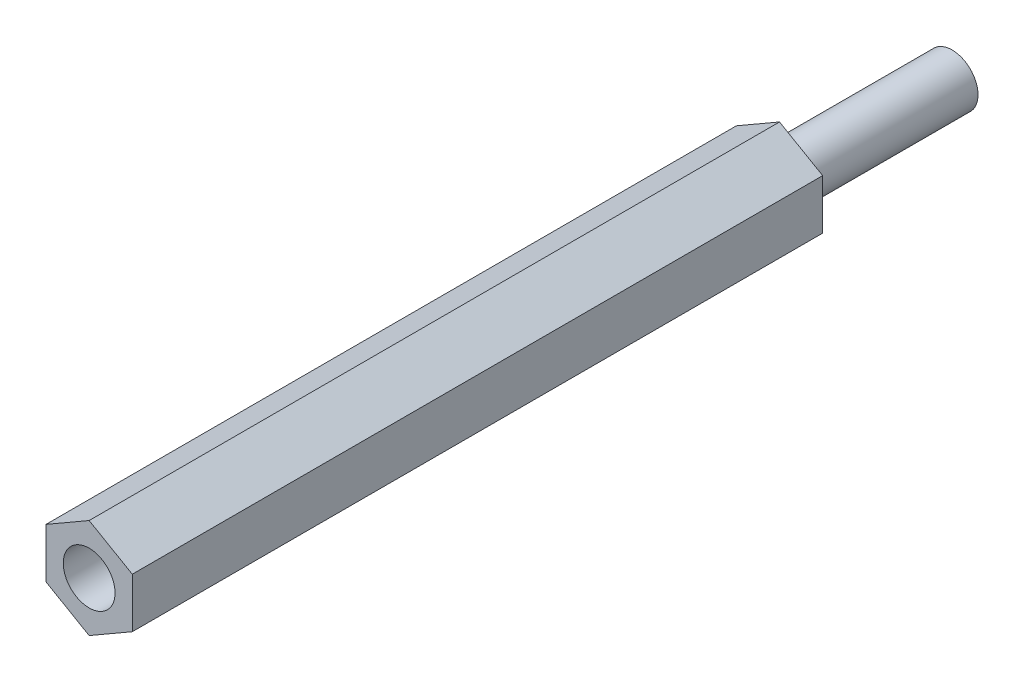
ISO-10303-21;
HEADER;
FILE_DESCRIPTION(('STEP AP214'),'2;1');
FILE_NAME('part.step','',(''),(''),'','','');
FILE_SCHEMA(('AUTOMOTIVE_DESIGN { 1 0 10303 214 1 1 1 1 }'));
ENDSEC;
DATA;
#1=APPLICATION_CONTEXT('core data for automotive mechanical design processes');
#2=APPLICATION_PROTOCOL_DEFINITION('international standard','automotive_design',2000,#1);
#3=PRODUCT_CONTEXT('',#1,'mechanical');
#4=PRODUCT('Part','Part','',(#3));
#5=PRODUCT_RELATED_PRODUCT_CATEGORY('part','',(#4));
#6=PRODUCT_DEFINITION_FORMATION('','',#4);
#7=PRODUCT_DEFINITION_CONTEXT('part definition',#1,'design');
#8=PRODUCT_DEFINITION('design','',#6,#7);
#9=PRODUCT_DEFINITION_SHAPE('','',#8);
#10=(LENGTH_UNIT() NAMED_UNIT(*) SI_UNIT(.MILLI.,.METRE.));
#11=(NAMED_UNIT(*) PLANE_ANGLE_UNIT() SI_UNIT($,.RADIAN.));
#12=(NAMED_UNIT(*) SI_UNIT($,.STERADIAN.) SOLID_ANGLE_UNIT());
#13=UNCERTAINTY_MEASURE_WITH_UNIT(LENGTH_MEASURE(1.E-05),#10,'distance_accuracy_value','');
#14=(GEOMETRIC_REPRESENTATION_CONTEXT(3) GLOBAL_UNCERTAINTY_ASSIGNED_CONTEXT((#13)) GLOBAL_UNIT_ASSIGNED_CONTEXT((#10,
#11,#12)) REPRESENTATION_CONTEXT('',''));
#15=CARTESIAN_POINT('',(0.,0.,0.));
#16=DIRECTION('',(0.,0.,1.));
#17=DIRECTION('',(1.,0.,0.));
#18=AXIS2_PLACEMENT_3D('',#15,#16,#17);
#19=CARTESIAN_POINT('',(0.,0.,40.));
#20=DIRECTION('',(0.,0.,-1.));
#21=DIRECTION('',(-1.,0.,0.));
#22=AXIS2_PLACEMENT_3D('',#19,#20,#21);
#23=CYLINDRICAL_SURFACE('',#22,1.5);
#24=CARTESIAN_POINT('',(0.,0.,40.));
#25=DIRECTION('',(0.,0.,1.));
#26=DIRECTION('',(1.,0.,0.));
#27=AXIS2_PLACEMENT_3D('',#24,#25,#26);
#28=CIRCLE('',#27,1.5);
#29=CARTESIAN_POINT('',(1.5,0.,40.));
#30=VERTEX_POINT('',#29);
#31=EDGE_CURVE('E143',#30,#30,#28,.T.);
#32=ORIENTED_EDGE('',*,*,#31,.T.);
#33=EDGE_LOOP('',(#32));
#34=FACE_BOUND('',#33,.T.);
#35=CARTESIAN_POINT('',(0.,0.,30.));
#36=DIRECTION('',(0.,0.,-1.));
#37=DIRECTION('',(-1.,0.,0.));
#38=AXIS2_PLACEMENT_3D('',#35,#36,#37);
#39=CIRCLE('',#38,1.5);
#40=CARTESIAN_POINT('',(-1.5,0.,30.));
#41=VERTEX_POINT('',#40);
#42=EDGE_CURVE('E249',#41,#41,#39,.T.);
#43=ORIENTED_EDGE('',*,*,#42,.T.);
#44=EDGE_LOOP('',(#43));
#45=FACE_BOUND('',#44,.T.);
#46=ADVANCED_FACE('F53',(#34,#45),#23,.F.);
#47=CARTESIAN_POINT('',(0.,0.,40.));
#48=DIRECTION('',(0.,0.,1.));
#49=DIRECTION('',(1.,0.,0.));
#50=AXIS2_PLACEMENT_3D('',#47,#48,#49);
#51=PLANE('',#50);
#52=DIRECTION('',(0.866025403784439,-0.5,0.));
#53=VECTOR('',#52,1.);
#54=CARTESIAN_POINT('',(-2.5,-1.44337567297406,40.));
#55=LINE('',#54,#53);
#56=CARTESIAN_POINT('',(-2.5,-1.44337567297406,40.));
#57=VERTEX_POINT('',#56);
#58=CARTESIAN_POINT('',(0.,-2.88675134594813,40.));
#59=VERTEX_POINT('',#58);
#60=EDGE_CURVE('E150',#57,#59,#55,.T.);
#61=ORIENTED_EDGE('',*,*,#60,.T.);
#62=DIRECTION('',(0.866025403784438,0.5,0.));
#63=VECTOR('',#62,1.);
#64=CARTESIAN_POINT('',(0.,-2.88675134594813,40.));
#65=LINE('',#64,#63);
#66=CARTESIAN_POINT('',(2.5,-1.44337567297406,40.));
#67=VERTEX_POINT('',#66);
#68=EDGE_CURVE('E107',#59,#67,#65,.T.);
#69=ORIENTED_EDGE('',*,*,#68,.T.);
#70=DIRECTION('',(0.,1.,0.));
#71=VECTOR('',#70,1.);
#72=CARTESIAN_POINT('',(2.5,-1.44337567297406,40.));
#73=LINE('',#72,#71);
#74=CARTESIAN_POINT('',(2.5,1.44337567297407,40.));
#75=VERTEX_POINT('',#74);
#76=EDGE_CURVE('E121',#67,#75,#73,.T.);
#77=ORIENTED_EDGE('',*,*,#76,.T.);
#78=DIRECTION('',(-0.866025403784439,0.5,0.));
#79=VECTOR('',#78,1.);
#80=CARTESIAN_POINT('',(2.5,1.44337567297407,40.));
#81=LINE('',#80,#79);
#82=CARTESIAN_POINT('',(0.,2.88675134594813,40.));
#83=VERTEX_POINT('',#82);
#84=EDGE_CURVE('E114',#75,#83,#81,.T.);
#85=ORIENTED_EDGE('',*,*,#84,.T.);
#86=DIRECTION('',(-0.866025403784439,-0.5,0.));
#87=VECTOR('',#86,1.);
#88=CARTESIAN_POINT('',(0.,2.88675134594813,40.));
#89=LINE('',#88,#87);
#90=CARTESIAN_POINT('',(-2.5,1.44337567297406,40.));
#91=VERTEX_POINT('',#90);
#92=EDGE_CURVE('E119',#83,#91,#89,.T.);
#93=ORIENTED_EDGE('',*,*,#92,.T.);
#94=DIRECTION('',(0.,-1.,0.));
#95=VECTOR('',#94,1.);
#96=CARTESIAN_POINT('',(-2.5,1.44337567297406,40.));
#97=LINE('',#96,#95);
#98=EDGE_CURVE('E70',#91,#57,#97,.T.);
#99=ORIENTED_EDGE('',*,*,#98,.T.);
#100=EDGE_LOOP('',(#61,#69,#77,#85,#93,#99));
#101=FACE_BOUND('',#100,.T.);
#102=ORIENTED_EDGE('',*,*,#31,.F.);
#103=EDGE_LOOP('',(#102));
#104=FACE_BOUND('',#103,.T.);
#105=ADVANCED_FACE('F116',(#101,#104),#51,.T.);
#106=CARTESIAN_POINT('',(0.,0.,0.));
#107=DIRECTION('',(0.,0.,1.));
#108=DIRECTION('',(1.,0.,0.));
#109=AXIS2_PLACEMENT_3D('',#106,#107,#108);
#110=PLANE('',#109);
#111=DIRECTION('',(0.866025403784439,-0.5,0.));
#112=VECTOR('',#111,1.);
#113=CARTESIAN_POINT('',(-2.5,-1.44337567297406,0.));
#114=LINE('',#113,#112);
#115=CARTESIAN_POINT('',(-2.5,-1.44337567297406,0.));
#116=VERTEX_POINT('',#115);
#117=CARTESIAN_POINT('',(0.,-2.88675134594813,0.));
#118=VERTEX_POINT('',#117);
#119=EDGE_CURVE('E139',#116,#118,#114,.T.);
#120=ORIENTED_EDGE('',*,*,#119,.F.);
#121=DIRECTION('',(0.,-1.,0.));
#122=VECTOR('',#121,1.);
#123=CARTESIAN_POINT('',(-2.5,1.44337567297406,0.));
#124=LINE('',#123,#122);
#125=CARTESIAN_POINT('',(-2.5,1.44337567297406,0.));
#126=VERTEX_POINT('',#125);
#127=EDGE_CURVE('E99',#126,#116,#124,.T.);
#128=ORIENTED_EDGE('',*,*,#127,.F.);
#129=DIRECTION('',(-0.866025403784439,-0.5,0.));
#130=VECTOR('',#129,1.);
#131=CARTESIAN_POINT('',(0.,2.88675134594813,0.));
#132=LINE('',#131,#130);
#133=CARTESIAN_POINT('',(0.,2.88675134594813,0.));
#134=VERTEX_POINT('',#133);
#135=EDGE_CURVE('E93',#134,#126,#132,.T.);
#136=ORIENTED_EDGE('',*,*,#135,.F.);
#137=DIRECTION('',(-0.866025403784439,0.5,0.));
#138=VECTOR('',#137,1.);
#139=CARTESIAN_POINT('',(2.5,1.44337567297407,0.));
#140=LINE('',#139,#138);
#141=CARTESIAN_POINT('',(2.5,1.44337567297407,0.));
#142=VERTEX_POINT('',#141);
#143=EDGE_CURVE('E129',#142,#134,#140,.T.);
#144=ORIENTED_EDGE('',*,*,#143,.F.);
#145=DIRECTION('',(0.,1.,0.));
#146=VECTOR('',#145,1.);
#147=CARTESIAN_POINT('',(2.5,-1.44337567297406,0.));
#148=LINE('',#147,#146);
#149=CARTESIAN_POINT('',(2.5,-1.44337567297406,0.));
#150=VERTEX_POINT('',#149);
#151=EDGE_CURVE('E145',#150,#142,#148,.T.);
#152=ORIENTED_EDGE('',*,*,#151,.F.);
#153=DIRECTION('',(0.866025403784438,0.5,0.));
#154=VECTOR('',#153,1.);
#155=CARTESIAN_POINT('',(0.,-2.88675134594813,0.));
#156=LINE('',#155,#154);
#157=EDGE_CURVE('E142',#118,#150,#156,.T.);
#158=ORIENTED_EDGE('',*,*,#157,.F.);
#159=EDGE_LOOP('',(#120,#128,#136,#144,#152,#158));
#160=FACE_BOUND('',#159,.T.);
#161=CARTESIAN_POINT('',(0.,0.,0.));
#162=DIRECTION('',(0.,0.,1.));
#163=DIRECTION('',(1.,0.,0.));
#164=AXIS2_PLACEMENT_3D('',#161,#162,#163);
#165=CIRCLE('',#164,1.5);
#166=CARTESIAN_POINT('',(1.5,0.,0.));
#167=VERTEX_POINT('',#166);
#168=EDGE_CURVE('E248',#167,#167,#165,.F.);
#169=ORIENTED_EDGE('',*,*,#168,.F.);
#170=EDGE_LOOP('',(#169));
#171=FACE_BOUND('',#170,.T.);
#172=ADVANCED_FACE('F159',(#160,#171),#110,.F.);
#173=CARTESIAN_POINT('',(-2.5,-1.44337567297406,40.));
#174=DIRECTION('',(0.5,0.866025403784439,0.));
#175=DIRECTION('',(-0.866025403784439,0.5,0.));
#176=AXIS2_PLACEMENT_3D('',#173,#174,#175);
#177=PLANE('',#176);
#178=ORIENTED_EDGE('',*,*,#119,.T.);
#179=DIRECTION('',(0.,0.,-1.));
#180=VECTOR('',#179,1.);
#181=CARTESIAN_POINT('',(0.,-2.88675134594813,40.));
#182=LINE('',#181,#180);
#183=EDGE_CURVE('E12',#59,#118,#182,.T.);
#184=ORIENTED_EDGE('',*,*,#183,.F.);
#185=ORIENTED_EDGE('',*,*,#60,.F.);
#186=DIRECTION('',(0.,0.,-1.));
#187=VECTOR('',#186,1.);
#188=CARTESIAN_POINT('',(-2.5,-1.44337567297406,40.));
#189=LINE('',#188,#187);
#190=EDGE_CURVE('E135',#57,#116,#189,.T.);
#191=ORIENTED_EDGE('',*,*,#190,.T.);
#192=EDGE_LOOP('',(#178,#184,#185,#191));
#193=FACE_BOUND('',#192,.T.);
#194=ADVANCED_FACE('F55',(#193),#177,.F.);
#195=CARTESIAN_POINT('',(0.,-2.88675134594813,40.));
#196=DIRECTION('',(-0.5,0.866025403784439,0.));
#197=DIRECTION('',(-0.866025403784439,-0.5,0.));
#198=AXIS2_PLACEMENT_3D('',#195,#196,#197);
#199=PLANE('',#198);
#200=ORIENTED_EDGE('',*,*,#157,.T.);
#201=DIRECTION('',(0.,0.,-1.));
#202=VECTOR('',#201,1.);
#203=CARTESIAN_POINT('',(2.5,-1.44337567297406,40.));
#204=LINE('',#203,#202);
#205=EDGE_CURVE('E62',#67,#150,#204,.T.);
#206=ORIENTED_EDGE('',*,*,#205,.F.);
#207=ORIENTED_EDGE('',*,*,#68,.F.);
#208=ORIENTED_EDGE('',*,*,#183,.T.);
#209=EDGE_LOOP('',(#200,#206,#207,#208));
#210=FACE_BOUND('',#209,.T.);
#211=ADVANCED_FACE('F192',(#210),#199,.F.);
#212=CARTESIAN_POINT('',(2.5,-1.44337567297406,40.));
#213=DIRECTION('',(-1.,0.,0.));
#214=DIRECTION('',(0.,-1.,0.));
#215=AXIS2_PLACEMENT_3D('',#212,#213,#214);
#216=PLANE('',#215);
#217=ORIENTED_EDGE('',*,*,#151,.T.);
#218=DIRECTION('',(0.,0.,-1.));
#219=VECTOR('',#218,1.);
#220=CARTESIAN_POINT('',(2.5,1.44337567297407,40.));
#221=LINE('',#220,#219);
#222=EDGE_CURVE('E130',#75,#142,#221,.T.);
#223=ORIENTED_EDGE('',*,*,#222,.F.);
#224=ORIENTED_EDGE('',*,*,#76,.F.);
#225=ORIENTED_EDGE('',*,*,#205,.T.);
#226=EDGE_LOOP('',(#217,#223,#224,#225));
#227=FACE_BOUND('',#226,.T.);
#228=ADVANCED_FACE('F156',(#227),#216,.F.);
#229=CARTESIAN_POINT('',(2.5,1.44337567297407,40.));
#230=DIRECTION('',(-0.5,-0.866025403784439,0.));
#231=DIRECTION('',(0.866025403784439,-0.5,0.));
#232=AXIS2_PLACEMENT_3D('',#229,#230,#231);
#233=PLANE('',#232);
#234=ORIENTED_EDGE('',*,*,#143,.T.);
#235=DIRECTION('',(0.,0.,-1.));
#236=VECTOR('',#235,1.);
#237=CARTESIAN_POINT('',(0.,2.88675134594813,40.));
#238=LINE('',#237,#236);
#239=EDGE_CURVE('E126',#83,#134,#238,.T.);
#240=ORIENTED_EDGE('',*,*,#239,.F.);
#241=ORIENTED_EDGE('',*,*,#84,.F.);
#242=ORIENTED_EDGE('',*,*,#222,.T.);
#243=EDGE_LOOP('',(#234,#240,#241,#242));
#244=FACE_BOUND('',#243,.T.);
#245=ADVANCED_FACE('F127',(#244),#233,.F.);
#246=CARTESIAN_POINT('',(0.,2.88675134594813,40.));
#247=DIRECTION('',(0.5,-0.866025403784439,0.));
#248=DIRECTION('',(0.866025403784439,0.5,0.));
#249=AXIS2_PLACEMENT_3D('',#246,#247,#248);
#250=PLANE('',#249);
#251=ORIENTED_EDGE('',*,*,#135,.T.);
#252=DIRECTION('',(0.,0.,-1.));
#253=VECTOR('',#252,1.);
#254=CARTESIAN_POINT('',(-2.5,1.44337567297406,40.));
#255=LINE('',#254,#253);
#256=EDGE_CURVE('E131',#91,#126,#255,.T.);
#257=ORIENTED_EDGE('',*,*,#256,.F.);
#258=ORIENTED_EDGE('',*,*,#92,.F.);
#259=ORIENTED_EDGE('',*,*,#239,.T.);
#260=EDGE_LOOP('',(#251,#257,#258,#259));
#261=FACE_BOUND('',#260,.T.);
#262=ADVANCED_FACE('F133',(#261),#250,.F.);
#263=CARTESIAN_POINT('',(-2.5,1.44337567297406,40.));
#264=DIRECTION('',(1.,0.,0.));
#265=DIRECTION('',(0.,1.,0.));
#266=AXIS2_PLACEMENT_3D('',#263,#264,#265);
#267=PLANE('',#266);
#268=ORIENTED_EDGE('',*,*,#127,.T.);
#269=ORIENTED_EDGE('',*,*,#190,.F.);
#270=ORIENTED_EDGE('',*,*,#98,.F.);
#271=ORIENTED_EDGE('',*,*,#256,.T.);
#272=EDGE_LOOP('',(#268,#269,#270,#271));
#273=FACE_BOUND('',#272,.T.);
#274=ADVANCED_FACE('F164',(#273),#267,.F.);
#275=CARTESIAN_POINT('',(0.,0.,30.));
#276=DIRECTION('',(0.,0.,-1.));
#277=DIRECTION('',(-1.,0.,0.));
#278=AXIS2_PLACEMENT_3D('',#275,#276,#277);
#279=PLANE('',#278);
#280=ORIENTED_EDGE('',*,*,#42,.F.);
#281=EDGE_LOOP('',(#280));
#282=FACE_BOUND('',#281,.T.);
#283=ADVANCED_FACE('F166',(#282),#279,.F.);
#284=CARTESIAN_POINT('',(0.,0.,-10.));
#285=DIRECTION('',(0.,0.,1.));
#286=DIRECTION('',(1.,0.,0.));
#287=AXIS2_PLACEMENT_3D('',#284,#285,#286);
#288=CYLINDRICAL_SURFACE('',#287,1.5);
#289=CARTESIAN_POINT('',(0.,0.,-10.));
#290=DIRECTION('',(0.,0.,-1.));
#291=DIRECTION('',(-1.,0.,0.));
#292=AXIS2_PLACEMENT_3D('',#289,#290,#291);
#293=CIRCLE('',#292,1.5);
#294=CARTESIAN_POINT('',(-1.5,0.,-10.));
#295=VERTEX_POINT('',#294);
#296=EDGE_CURVE('E247',#295,#295,#293,.T.);
#297=ORIENTED_EDGE('',*,*,#296,.F.);
#298=EDGE_LOOP('',(#297));
#299=FACE_BOUND('',#298,.T.);
#300=ORIENTED_EDGE('',*,*,#168,.T.);
#301=EDGE_LOOP('',(#300));
#302=FACE_BOUND('',#301,.T.);
#303=ADVANCED_FACE('F172',(#299,#302),#288,.T.);
#304=CARTESIAN_POINT('',(0.,0.,-10.));
#305=DIRECTION('',(0.,0.,-1.));
#306=DIRECTION('',(-1.,0.,0.));
#307=AXIS2_PLACEMENT_3D('',#304,#305,#306);
#308=PLANE('',#307);
#309=ORIENTED_EDGE('',*,*,#296,.T.);
#310=EDGE_LOOP('',(#309));
#311=FACE_BOUND('',#310,.T.);
#312=ADVANCED_FACE('F233',(#311),#308,.T.);
#313=CLOSED_SHELL('',(#46,#105,#172,#194,#211,#228,#245,#262,#274,#283,#303,#312));
#314=MANIFOLD_SOLID_BREP('B2',#313);
#315=ADVANCED_BREP_SHAPE_REPRESENTATION('',(#18,#314),#14);
#316=SHAPE_DEFINITION_REPRESENTATION(#9,#315);
ENDSEC;
END-ISO-10303-21;
